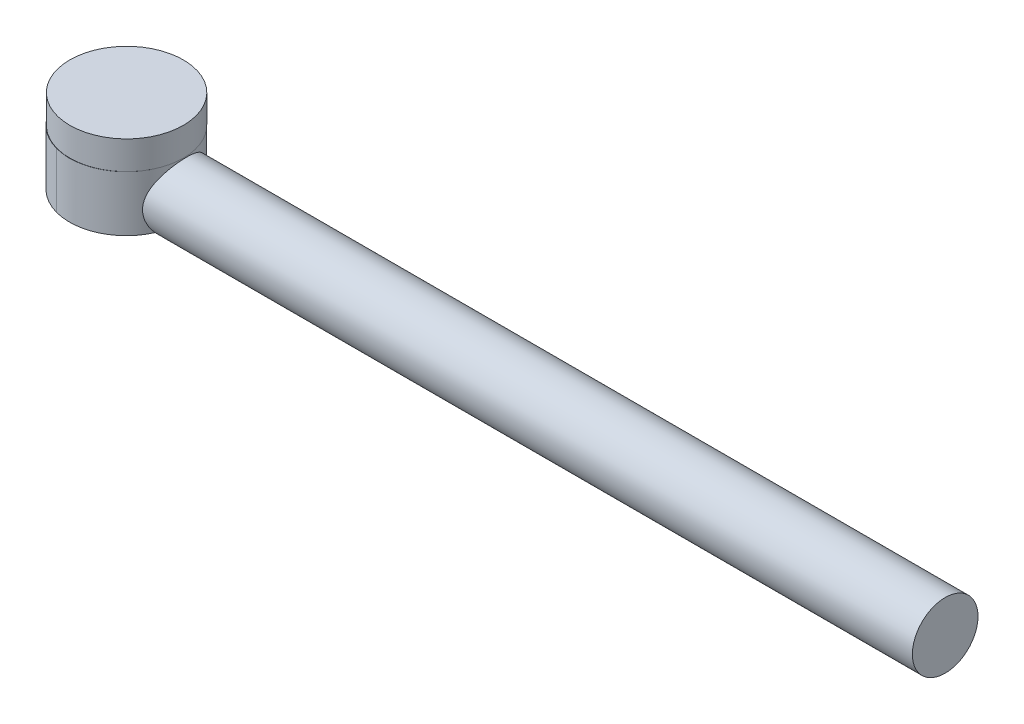
ISO-10303-21;
HEADER;
FILE_DESCRIPTION(('STEP AP214'),'2;1');
FILE_NAME('part.step','',(''),(''),'','','');
FILE_SCHEMA(('AUTOMOTIVE_DESIGN { 1 0 10303 214 1 1 1 1 }'));
ENDSEC;
DATA;
#1=APPLICATION_CONTEXT('core data for automotive mechanical design processes');
#2=APPLICATION_PROTOCOL_DEFINITION('international standard','automotive_design',2000,#1);
#3=PRODUCT_CONTEXT('',#1,'mechanical');
#4=PRODUCT('Part','Part','',(#3));
#5=PRODUCT_RELATED_PRODUCT_CATEGORY('part','',(#4));
#6=PRODUCT_DEFINITION_FORMATION('','',#4);
#7=PRODUCT_DEFINITION_CONTEXT('part definition',#1,'design');
#8=PRODUCT_DEFINITION('design','',#6,#7);
#9=PRODUCT_DEFINITION_SHAPE('','',#8);
#10=(LENGTH_UNIT() NAMED_UNIT(*) SI_UNIT(.MILLI.,.METRE.));
#11=(NAMED_UNIT(*) PLANE_ANGLE_UNIT() SI_UNIT($,.RADIAN.));
#12=(NAMED_UNIT(*) SI_UNIT($,.STERADIAN.) SOLID_ANGLE_UNIT());
#13=UNCERTAINTY_MEASURE_WITH_UNIT(LENGTH_MEASURE(1.E-05),#10,'distance_accuracy_value','');
#14=(GEOMETRIC_REPRESENTATION_CONTEXT(3) GLOBAL_UNCERTAINTY_ASSIGNED_CONTEXT((#13)) GLOBAL_UNIT_ASSIGNED_CONTEXT((#10,
#11,#12)) REPRESENTATION_CONTEXT('',''));
#15=CARTESIAN_POINT('',(0.,0.,0.));
#16=DIRECTION('',(0.,0.,1.));
#17=DIRECTION('',(1.,0.,0.));
#18=AXIS2_PLACEMENT_3D('',#15,#16,#17);
#19=CARTESIAN_POINT('',(64.8930840119267,57.1338139318965,55.1677389958048));
#20=DIRECTION('',(0.,-1.,0.));
#21=DIRECTION('',(0.,0.,-1.));
#22=AXIS2_PLACEMENT_3D('',#19,#20,#21);
#23=CYLINDRICAL_SURFACE('',#22,4.41488839314275);
#24=CARTESIAN_POINT('',(64.8930840119267,52.4498767005648,55.1677389958048));
#25=DIRECTION('',(0.,-1.,0.));
#26=DIRECTION('',(0.,0.,-1.));
#27=AXIS2_PLACEMENT_3D('',#24,#25,#26);
#28=CIRCLE('',#27,4.41488839314275);
#29=CARTESIAN_POINT('',(68.9050330531825,52.4498767005648,53.3250495444121));
#30=VERTEX_POINT('',#29);
#31=CARTESIAN_POINT('',(68.9909113998588,52.4498767005648,56.8106176348467));
#32=VERTEX_POINT('',#31);
#33=EDGE_CURVE('E207',#30,#32,#28,.T.);
#34=ORIENTED_EDGE('',*,*,#33,.F.);
#35=CARTESIAN_POINT('',(68.9909113998588,52.4498767005648,56.8106176348467));
#36=CARTESIAN_POINT('',(69.0078144566787,52.4016003833655,56.7684562948141));
#37=CARTESIAN_POINT('',(69.0247520904262,52.3550984496615,56.7243228512433));
#38=CARTESIAN_POINT('',(69.0582744814169,52.2658412597585,56.6322636013886));
#39=CARTESIAN_POINT('',(69.0748591168852,52.223087281135,56.5843365124668));
#40=CARTESIAN_POINT('',(69.1235446550623,52.1005096451875,56.4347934837326));
#41=CARTESIAN_POINT('',(69.1544541927399,52.026707648206,56.3277099660643));
#42=CARTESIAN_POINT('',(69.2097688504635,51.8973748785394,56.1010740903618));
#43=CARTESIAN_POINT('',(69.2341556601447,51.8418954400154,55.981487915739));
#44=CARTESIAN_POINT('',(69.2733733965552,51.7518590970686,55.7334175479235));
#45=CARTESIAN_POINT('',(69.288226397483,51.717253872611,55.6049546776448));
#46=CARTESIAN_POINT('',(69.3057470569595,51.6723307268607,55.3531128553064));
#47=CARTESIAN_POINT('',(69.309251143556,51.6603742627659,55.2300839241146));
#48=CARTESIAN_POINT('',(69.3058564218788,51.6562143034587,54.9838018676563));
#49=CARTESIAN_POINT('',(69.2989562245471,51.6640134458781,54.8605487146486));
#50=CARTESIAN_POINT('',(69.2760119066459,51.6977738442605,54.6252222311309));
#51=CARTESIAN_POINT('',(69.2605496016604,51.72260132873,54.5129249264647));
#52=CARTESIAN_POINT('',(69.2221510350125,51.7880883900838,54.2943912230823));
#53=CARTESIAN_POINT('',(69.1992121795555,51.8287534623621,54.1881569428261));
#54=CARTESIAN_POINT('',(69.1462001500448,51.927057981311,53.9783745022753));
#55=CARTESIAN_POINT('',(69.1158068264948,51.9855002935762,53.8752866279368));
#56=CARTESIAN_POINT('',(69.0510530494522,52.1166317011213,53.6800902535957));
#57=CARTESIAN_POINT('',(69.0166952572105,52.1893112618858,53.5879744717394));
#58=CARTESIAN_POINT('',(68.9689940424682,52.2969467631523,53.4708777996079));
#59=CARTESIAN_POINT('',(68.9562041303722,52.3264455469264,53.4405060421464));
#60=CARTESIAN_POINT('',(68.9306066087802,52.3869970260983,53.3814913803797));
#61=CARTESIAN_POINT('',(68.9177990802419,52.4180466334875,53.3528452727451));
#62=CARTESIAN_POINT('',(68.9050330531825,52.4498767005648,53.3250495444121));
#63=B_SPLINE_CURVE_WITH_KNOTS('',3,(#35,#36,#37,#38,#39,#40,#41,#42,#43,#44,#45,#46,#47,#48,#49,
#50,#51,#52,#53,#54,#55,#56,#57,#58,#59,#60,#61,#62),.UNSPECIFIED.,.F.,.F.,(4,2,2,2,2,2,2,2,2,2,
2,2,2,4),(0.,0.198746322642264,0.397560131155452,0.796564027129921,1.19667650861936,
1.59585921179006,1.96485942895716,2.33390891507627,2.68050697655425,3.02722540941497,
3.39279986113568,3.75813032385048,3.8907719823973,4.02315930678074),.UNSPECIFIED.);
#64=EDGE_CURVE('E171',#32,#30,#63,.T.);
#65=ORIENTED_EDGE('',*,*,#64,.F.);
#66=EDGE_LOOP('',(#34,#65));
#67=FACE_BOUND('',#66,.T.);
#68=ADVANCED_FACE('F39',(#67),#23,.F.);
#69=CARTESIAN_POINT('',(117.003928845521,53.9716158859328,55.0678335896294));
#70=DIRECTION('',(-1.,0.,0.));
#71=DIRECTION('',(0.,0.,1.));
#72=AXIS2_PLACEMENT_3D('',#69,#70,#71);
#73=CYLINDRICAL_SURFACE('',#72,2.31365217276674);
#74=CARTESIAN_POINT('',(68.5434227720107,52.4498767005648,56.8106176348467));
#75=CARTESIAN_POINT('',(68.5069523907389,52.5439531886697,56.892758787755));
#76=CARTESIAN_POINT('',(68.4704429118868,52.6448198490284,56.9674021232075));
#77=CARTESIAN_POINT('',(68.4012058045429,52.8590733863416,57.100385877513));
#78=CARTESIAN_POINT('',(68.3685092300784,52.9725501051983,57.1585972660198));
#79=CARTESIAN_POINT('',(68.3113198740907,53.2099783286772,57.2563069141519));
#80=CARTESIAN_POINT('',(68.2868630544629,53.3339728673884,57.295723447517));
#81=CARTESIAN_POINT('',(68.250536757608,53.5881982556529,57.3531888268447));
#82=CARTESIAN_POINT('',(68.2386166017318,53.7184017552519,57.3713237371143));
#83=CARTESIAN_POINT('',(68.2300400054733,53.965710159397,57.3844101443614));
#84=CARTESIAN_POINT('',(68.2318158441557,54.0826389412693,57.3817424074699));
#85=CARTESIAN_POINT('',(68.2466666219809,54.3141348096545,57.3589486797945));
#86=CARTESIAN_POINT('',(68.259752481922,54.4286995039332,57.3388058152008));
#87=CARTESIAN_POINT('',(68.2943309625598,54.6463749177604,57.2836096320574));
#88=CARTESIAN_POINT('',(68.3153595295227,54.7497717750421,57.2493713544843));
#89=CARTESIAN_POINT('',(68.3633612558271,54.9495565896685,57.1674253796885));
#90=CARTESIAN_POINT('',(68.3903353703013,55.0459434175623,57.1197155179536));
#91=CARTESIAN_POINT('',(68.4516260932584,55.2431932682411,57.0045470524501));
#92=CARTESIAN_POINT('',(68.4864422805773,55.3428405659077,56.9352723492761));
#93=CARTESIAN_POINT('',(68.5568931472737,55.5300241760108,56.7821815616824));
#94=CARTESIAN_POINT('',(68.5925285025695,55.6175500354794,56.6983530653938));
#95=CARTESIAN_POINT('',(68.665224454118,55.7881267423965,56.5071037579072));
#96=CARTESIAN_POINT('',(68.70198407683,55.8695287347883,56.3980826349448));
#97=CARTESIAN_POINT('',(68.7681123213135,56.0127056371901,56.1657945959757));
#98=CARTESIAN_POINT('',(68.7974848632292,56.074490961877,56.0425352867258));
#99=CARTESIAN_POINT('',(68.8436674338879,56.1726197516924,55.7927320422765));
#100=CARTESIAN_POINT('',(68.8611217768142,56.2102599294052,55.6668215575319));
#101=CARTESIAN_POINT('',(68.883815803044,56.263674931703,55.4094173137681));
#102=CARTESIAN_POINT('',(68.8890676966856,56.2794716074959,55.2779292702255));
#103=CARTESIAN_POINT('',(68.8865745135595,56.2878769225979,55.0301657704793));
#104=CARTESIAN_POINT('',(68.8803092424062,56.2830337060447,54.9139523954384));
#105=CARTESIAN_POINT('',(68.8579830745171,56.2562121373519,54.6844995933471));
#106=CARTESIAN_POINT('',(68.8419220369644,56.2342335388852,54.5712602090732));
#107=CARTESIAN_POINT('',(68.8015268543295,56.174709964582,54.3522328259717));
#108=CARTESIAN_POINT('',(68.7773055600629,56.1373758674948,54.2463657661398));
#109=CARTESIAN_POINT('',(68.7223113561808,56.0486704720295,54.0425556114575));
#110=CARTESIAN_POINT('',(68.691537026242,55.9972961298439,53.9446142408045));
#111=CARTESIAN_POINT('',(68.6219739957701,55.8758766221286,53.7481762913562));
#112=CARTESIAN_POINT('',(68.5826810122348,55.8044267573874,53.6507287224704));
#113=CARTESIAN_POINT('',(68.5015858071243,55.647858814463,53.4685686215057));
#114=CARTESIAN_POINT('',(68.4597805944529,55.5627242327669,53.3838717083791));
#115=CARTESIAN_POINT('',(68.3717396838883,55.3685863168317,53.2185868632326));
#116=CARTESIAN_POINT('',(68.3256126663348,55.2579258699584,53.139874720141));
#117=CARTESIAN_POINT('',(68.2398300214246,55.0226729813135,53.0022150204724));
#118=CARTESIAN_POINT('',(68.2001665526644,54.8980977347025,52.9432434221986));
#119=CARTESIAN_POINT('',(68.1411233306512,54.6675209789133,52.8587380466352));
#120=CARTESIAN_POINT('',(68.1191753929839,54.5638592341841,52.8286296580635));
#121=CARTESIAN_POINT('',(68.0854346911226,54.3518113577123,52.783067104065));
#122=CARTESIAN_POINT('',(68.0736280364746,54.2434319023995,52.76759289135));
#123=CARTESIAN_POINT('',(68.061865383991,54.0244799771392,52.7521747590771));
#124=CARTESIAN_POINT('',(68.0619553226232,53.9139006550331,52.7522910393126));
#125=CARTESIAN_POINT('',(68.0740894736592,53.6945367118622,52.7681991964891));
#126=CARTESIAN_POINT('',(68.0861381287629,53.5857527730568,52.783996899127));
#127=CARTESIAN_POINT('',(68.1195455075176,53.3783086554792,52.8291492200346));
#128=CARTESIAN_POINT('',(68.1404223193227,53.2794134484894,52.8578062416556));
#129=CARTESIAN_POINT('',(68.1890407774928,53.0876940003465,52.9272543536874));
#130=CARTESIAN_POINT('',(68.2167903763456,52.9948769506443,52.9680595118112));
#131=CARTESIAN_POINT('',(68.2744877327509,52.8229872343318,53.057278053999));
#132=CARTESIAN_POINT('',(68.3041286004359,52.7434058997935,53.1049217426247));
#133=CARTESIAN_POINT('',(68.3652753037609,52.5913219924016,53.208749445156));
#134=CARTESIAN_POINT('',(68.396772956877,52.5187916189298,53.2648974823259));
#135=CARTESIAN_POINT('',(68.4283830151182,52.4498767005648,53.3250495444121));
#136=B_SPLINE_CURVE_WITH_KNOTS('',3,(#74,#75,#76,#77,#78,#79,#80,#81,#82,#83,#84,#85,#86,#87,
#88,#89,#90,#91,#92,#93,#94,#95,#96,#97,#98,#99,#100,#101,#102,#103,#104,#105,#106,#107,#108,
#109,#110,#111,#112,#113,#114,#115,#116,#117,#118,#119,#120,#121,#122,#123,#124,#125,#126,#127,
#128,#129,#130,#131,#132,#133,#134,#135),.UNSPECIFIED.,.F.,.F.,(4,2,2,2,2,2,2,2,2,2,2,2,2,2,2,2,
2,2,2,2,2,2,2,2,2,2,2,2,2,2,4),(0.,0.390241286275457,0.783466681757577,1.17838670135114,
1.57170407325067,1.92072892610733,2.27009116946562,2.60159030639108,2.93314273642647,
3.31041716073554,3.68801492973468,4.10867766020667,4.52911668189437,4.92450104713221,
5.31948960168543,5.667220976659,6.01495735048679,6.35806973189139,6.70125655627354,
7.08094650868229,7.46109784374455,7.88934817110292,8.31707502532974,8.64618555947265,
8.97484459078756,9.30477271432826,9.63482345307508,9.94880274100355,10.2631470450824,
10.5546173906287,10.8448874698322),.UNSPECIFIED.);
#137=CARTESIAN_POINT('',(68.5434227720107,52.4498767005648,56.8106176348467));
#138=VERTEX_POINT('',#137);
#139=CARTESIAN_POINT('',(68.5429433041329,52.4511130740517,56.8116964212793));
#140=VERTEX_POINT('',#139);
#141=EDGE_CURVE('E140',#138,#140,#136,.T.);
#142=ORIENTED_EDGE('',*,*,#141,.F.);
#143=DIRECTION('',(-1.,0.,0.));
#144=VECTOR('',#143,1.);
#145=CARTESIAN_POINT('',(117.003928845521,52.4498767005648,56.8106176348467));
#146=LINE('',#145,#144);
#147=EDGE_CURVE('E181',#138,#32,#146,.F.);
#148=ORIENTED_EDGE('',*,*,#147,.T.);
#149=ORIENTED_EDGE('',*,*,#64,.T.);
#150=DIRECTION('',(-1.,0.,0.));
#151=VECTOR('',#150,1.);
#152=CARTESIAN_POINT('',(117.003928845521,52.4498767005648,53.3250495444121));
#153=LINE('',#152,#151);
#154=CARTESIAN_POINT('',(68.4283830151182,52.4498767005648,53.3250495444121));
#155=VERTEX_POINT('',#154);
#156=EDGE_CURVE('E180',#30,#155,#153,.T.);
#157=ORIENTED_EDGE('',*,*,#156,.T.);
#158=CARTESIAN_POINT('',(68.4278155881121,52.4511130740517,53.3239707579795));
#159=VERTEX_POINT('',#158);
#160=EDGE_CURVE('E208',#159,#155,#136,.T.);
#161=ORIENTED_EDGE('',*,*,#160,.F.);
#162=DIRECTION('',(-1.,0.,0.));
#163=VECTOR('',#162,1.);
#164=CARTESIAN_POINT('',(117.003928845521,52.4511130740516,53.3239707579795));
#165=LINE('',#164,#163);
#166=CARTESIAN_POINT('',(68.5670172295317,52.4511130740516,53.3239707579795));
#167=VERTEX_POINT('',#166);
#168=EDGE_CURVE('E283',#167,#159,#165,.T.);
#169=ORIENTED_EDGE('',*,*,#168,.F.);
#170=ORIENTED_EDGE('',*,*,#168,.T.);
#171=EDGE_CURVE('E157',#140,#159,#136,.T.);
#172=ORIENTED_EDGE('',*,*,#171,.F.);
#173=DIRECTION('',(-1.,0.,0.));
#174=VECTOR('',#173,1.);
#175=CARTESIAN_POINT('',(117.003928845521,52.4511130740516,56.8116964212793));
#176=LINE('',#175,#174);
#177=CARTESIAN_POINT('',(68.6601116588463,52.4511130740516,56.8116964212793));
#178=VERTEX_POINT('',#177);
#179=EDGE_CURVE('E285',#140,#178,#176,.F.);
#180=ORIENTED_EDGE('',*,*,#179,.T.);
#181=ORIENTED_EDGE('',*,*,#179,.F.);
#182=EDGE_LOOP('',(#142,#148,#149,#157,#161,#169,#170,#172,#180,#181));
#183=FACE_BOUND('',#182,.T.);
#184=CARTESIAN_POINT('',(122.503928845521,53.9716158859328,55.0678335896294));
#185=DIRECTION('',(1.,0.,0.));
#186=DIRECTION('',(0.,0.,-1.));
#187=AXIS2_PLACEMENT_3D('',#184,#185,#186);
#188=CIRCLE('',#187,2.31365217276674);
#189=CARTESIAN_POINT('',(122.503928845521,53.9716158859328,52.7541814168627));
#190=VERTEX_POINT('',#189);
#191=EDGE_CURVE('E271',#190,#190,#188,.T.);
#192=ORIENTED_EDGE('',*,*,#191,.F.);
#193=EDGE_LOOP('',(#192));
#194=FACE_BOUND('',#193,.T.);
#195=ADVANCED_FACE('F183',(#183,#194),#73,.T.);
#196=CARTESIAN_POINT('',(64.8879459892055,56.3538758021107,55.1865826936057));
#197=DIRECTION('',(0.,-1.,0.));
#198=DIRECTION('',(-0.964778994398282,0.,-0.263061764549393));
#199=AXIS2_PLACEMENT_3D('',#196,#197,#198);
#200=CYLINDRICAL_SURFACE('',#199,4.);
#201=ORIENTED_EDGE('',*,*,#171,.T.);
#202=CARTESIAN_POINT('',(64.8879459892055,52.4511130740516,55.1865826936057));
#203=DIRECTION('',(0.,1.,0.));
#204=DIRECTION('',(0.,0.,1.));
#205=AXIS2_PLACEMENT_3D('',#202,#203,#204);
#206=CIRCLE('',#205,4.);
#207=CARTESIAN_POINT('',(65.940193047403,52.4511130740516,51.3274667160125));
#208=VERTEX_POINT('',#207);
#209=EDGE_CURVE('E145',#159,#208,#206,.T.);
#210=ORIENTED_EDGE('',*,*,#209,.T.);
#211=DIRECTION('',(0.,-1.,0.));
#212=VECTOR('',#211,1.);
#213=CARTESIAN_POINT('',(65.940193047403,56.3538758021107,51.3274667160125));
#214=LINE('',#213,#212);
#215=CARTESIAN_POINT('',(65.940193047403,56.3538758021107,51.3274667160125));
#216=VERTEX_POINT('',#215);
#217=EDGE_CURVE('E152',#216,#208,#214,.T.);
#218=ORIENTED_EDGE('',*,*,#217,.F.);
#219=CARTESIAN_POINT('',(64.8879459892055,56.3538758021107,55.1865826936057));
#220=DIRECTION('',(0.,1.,0.));
#221=DIRECTION('',(0.964778994398282,0.,0.263061764549393));
#222=AXIS2_PLACEMENT_3D('',#219,#220,#221);
#223=CIRCLE('',#222,4.);
#224=CARTESIAN_POINT('',(68.6499324809759,56.3538758021107,56.5457948314771));
#225=VERTEX_POINT('',#224);
#226=EDGE_CURVE('E169',#225,#216,#223,.T.);
#227=ORIENTED_EDGE('',*,*,#226,.F.);
#228=CARTESIAN_POINT('',(63.835698931008,56.3538758021107,59.0456986711988));
#229=VERTEX_POINT('',#228);
#230=EDGE_CURVE('E114',#229,#225,#223,.T.);
#231=ORIENTED_EDGE('',*,*,#230,.F.);
#232=DIRECTION('',(0.,-1.,0.));
#233=VECTOR('',#232,1.);
#234=CARTESIAN_POINT('',(63.8356989310079,56.3538758021107,59.0456986711988));
#235=LINE('',#234,#233);
#236=CARTESIAN_POINT('',(63.8356989310079,52.4511130740516,59.0456986711988));
#237=VERTEX_POINT('',#236);
#238=EDGE_CURVE('E108',#229,#237,#235,.T.);
#239=ORIENTED_EDGE('',*,*,#238,.T.);
#240=EDGE_CURVE('E135',#237,#140,#206,.T.);
#241=ORIENTED_EDGE('',*,*,#240,.T.);
#242=EDGE_LOOP('',(#201,#210,#218,#227,#231,#239,#241));
#243=FACE_BOUND('',#242,.T.);
#244=ADVANCED_FACE('F154',(#243),#200,.T.);
#245=CARTESIAN_POINT('',(-26.7660584786313,56.3538758021107,30.1957150614133));
#246=DIRECTION('',(0.,1.,0.));
#247=DIRECTION('',(0.964778994398282,0.,0.263061764549393));
#248=AXIS2_PLACEMENT_3D('',#245,#246,#247);
#249=PLANE('',#248);
#250=CARTESIAN_POINT('',(64.8948077009227,56.3538758021107,55.1677389958048));
#251=DIRECTION('',(0.,1.,0.));
#252=DIRECTION('',(-1.,0.,0.));
#253=AXIS2_PLACEMENT_3D('',#250,#251,#252);
#254=CIRCLE('',#253,4.00000000000001);
#255=CARTESIAN_POINT('',(65.5565121931705,56.3538758021107,51.2228502565703));
#256=VERTEX_POINT('',#255);
#257=EDGE_CURVE('E120',#256,#225,#254,.T.);
#258=ORIENTED_EDGE('',*,*,#257,.F.);
#259=DIRECTION('',(0.964778994398282,0.,0.263061764549393));
#260=VECTOR('',#259,1.);
#261=CARTESIAN_POINT('',(-25.7138114204337,56.3538758021107,26.3365990838202));
#262=LINE('',#261,#260);
#263=CARTESIAN_POINT('',(65.4008600695111,56.3538758021107,51.1804093218656));
#264=VERTEX_POINT('',#263);
#265=EDGE_CURVE('E209',#264,#256,#262,.T.);
#266=ORIENTED_EDGE('',*,*,#265,.F.);
#267=CARTESIAN_POINT('',(64.8930840119267,56.3538758021107,55.1677389958048));
#268=DIRECTION('',(0.,1.,0.));
#269=DIRECTION('',(-1.,0.,0.));
#270=AXIS2_PLACEMENT_3D('',#267,#268,#269);
#271=CIRCLE('',#270,4.01953162113844);
#272=EDGE_CURVE('E105',#229,#264,#271,.F.);
#273=ORIENTED_EDGE('',*,*,#272,.F.);
#274=ORIENTED_EDGE('',*,*,#230,.T.);
#275=EDGE_LOOP('',(#258,#266,#273,#274));
#276=FACE_BOUND('',#275,.T.);
#277=ADVANCED_FACE('F240',(#276),#249,.T.);
#278=CARTESIAN_POINT('',(64.8930840119267,57.1338139318965,55.1677389958048));
#279=DIRECTION('',(0.,1.,0.));
#280=DIRECTION('',(0.,0.,1.));
#281=AXIS2_PLACEMENT_3D('',#278,#279,#280);
#282=CYLINDRICAL_SURFACE('',#281,4.01953162113844);
#283=DIRECTION('',(0.,1.,0.));
#284=VECTOR('',#283,1.);
#285=CARTESIAN_POINT('',(65.4008600695111,57.1338139318965,51.1804093218656));
#286=LINE('',#285,#284);
#287=CARTESIAN_POINT('',(65.4008600695111,52.4511130740516,51.1804093218656));
#288=VERTEX_POINT('',#287);
#289=EDGE_CURVE('E147',#264,#288,#286,.F.);
#290=ORIENTED_EDGE('',*,*,#289,.T.);
#291=CARTESIAN_POINT('',(64.8930840119267,52.4511130740516,55.1677389958048));
#292=DIRECTION('',(0.,1.,0.));
#293=DIRECTION('',(0.,0.,1.));
#294=AXIS2_PLACEMENT_3D('',#291,#292,#293);
#295=CIRCLE('',#294,4.01953162113844);
#296=EDGE_CURVE('E76',#288,#237,#295,.T.);
#297=ORIENTED_EDGE('',*,*,#296,.T.);
#298=ORIENTED_EDGE('',*,*,#238,.F.);
#299=ORIENTED_EDGE('',*,*,#272,.T.);
#300=EDGE_LOOP('',(#290,#297,#298,#299));
#301=FACE_BOUND('',#300,.T.);
#302=ADVANCED_FACE('F146',(#301),#282,.T.);
#303=CARTESIAN_POINT('',(-25.7138114204337,56.3538758021107,26.3365990838202));
#304=DIRECTION('',(0.263061764549393,0.,-0.964778994398282));
#305=DIRECTION('',(-0.964778994398282,0.,-0.263061764549393));
#306=AXIS2_PLACEMENT_3D('',#303,#304,#305);
#307=PLANE('',#306);
#308=DIRECTION('',(0.964778994398282,0.,0.263061764549393));
#309=VECTOR('',#308,1.);
#310=CARTESIAN_POINT('',(-25.7138114204337,52.4511130740516,26.3365990838202));
#311=LINE('',#310,#309);
#312=EDGE_CURVE('E170',#288,#208,#311,.T.);
#313=ORIENTED_EDGE('',*,*,#312,.F.);
#314=ORIENTED_EDGE('',*,*,#289,.F.);
#315=ORIENTED_EDGE('',*,*,#265,.T.);
#316=EDGE_CURVE('E210',#256,#216,#262,.T.);
#317=ORIENTED_EDGE('',*,*,#316,.T.);
#318=ORIENTED_EDGE('',*,*,#217,.T.);
#319=EDGE_LOOP('',(#313,#314,#315,#317,#318));
#320=FACE_BOUND('',#319,.T.);
#321=ADVANCED_FACE('F198',(#320),#307,.T.);
#322=ORIENTED_EDGE('',*,*,#240,.F.);
#323=CARTESIAN_POINT('',(63.8356989310079,52.4498767005648,59.0456986711988));
#324=VERTEX_POINT('',#323);
#325=EDGE_CURVE('E138',#237,#324,#235,.T.);
#326=ORIENTED_EDGE('',*,*,#325,.T.);
#327=CARTESIAN_POINT('',(64.8879459892055,52.4498767005648,55.1865826936057));
#328=DIRECTION('',(0.,1.,0.));
#329=DIRECTION('',(0.,0.,1.));
#330=AXIS2_PLACEMENT_3D('',#327,#328,#329);
#331=CIRCLE('',#330,4.);
#332=EDGE_CURVE('E151',#324,#138,#331,.T.);
#333=ORIENTED_EDGE('',*,*,#332,.T.);
#334=ORIENTED_EDGE('',*,*,#141,.T.);
#335=EDGE_LOOP('',(#322,#326,#333,#334));
#336=FACE_BOUND('',#335,.T.);
#337=ADVANCED_FACE('F136',(#336),#200,.T.);
#338=CARTESIAN_POINT('',(72.1919677870582,52.4498767005648,28.3990835020525));
#339=DIRECTION('',(0.,1.,0.));
#340=DIRECTION('',(0.,0.,1.));
#341=AXIS2_PLACEMENT_3D('',#338,#339,#340);
#342=PLANE('',#341);
#343=CARTESIAN_POINT('',(64.8930357480705,52.4498767005648,55.1677250772968));
#344=DIRECTION('',(0.,1.,0.));
#345=DIRECTION('',(0.,0.,1.));
#346=AXIS2_PLACEMENT_3D('',#343,#344,#345);
#347=CIRCLE('',#346,3.76068035935535);
#348=CARTESIAN_POINT('',(64.8930357480705,52.4498767005648,58.9284054366522));
#349=VERTEX_POINT('',#348);
#350=EDGE_CURVE('E43',#349,#349,#347,.T.);
#351=ORIENTED_EDGE('',*,*,#350,.T.);
#352=EDGE_LOOP('',(#351));
#353=FACE_BOUND('',#352,.T.);
#354=CARTESIAN_POINT('',(65.940193047403,52.4498767005648,51.3274667160125));
#355=VERTEX_POINT('',#354);
#356=EDGE_CURVE('E217',#155,#355,#331,.T.);
#357=ORIENTED_EDGE('',*,*,#356,.F.);
#358=ORIENTED_EDGE('',*,*,#156,.F.);
#359=ORIENTED_EDGE('',*,*,#33,.T.);
#360=ORIENTED_EDGE('',*,*,#147,.F.);
#361=ORIENTED_EDGE('',*,*,#332,.F.);
#362=CARTESIAN_POINT('',(64.8930840119267,52.4498767005648,55.1677389958048));
#363=DIRECTION('',(0.,1.,0.));
#364=DIRECTION('',(0.,0.,1.));
#365=AXIS2_PLACEMENT_3D('',#362,#363,#364);
#366=CIRCLE('',#365,4.01953162113844);
#367=CARTESIAN_POINT('',(65.4008600695111,52.4498767005648,51.1804093218656));
#368=VERTEX_POINT('',#367);
#369=EDGE_CURVE('E150',#368,#324,#366,.T.);
#370=ORIENTED_EDGE('',*,*,#369,.F.);
#371=DIRECTION('',(0.964778994398282,0.,0.263061764549393));
#372=VECTOR('',#371,1.);
#373=CARTESIAN_POINT('',(-25.7138114204337,52.4498767005648,26.3365990838202));
#374=LINE('',#373,#372);
#375=EDGE_CURVE('E218',#368,#355,#374,.T.);
#376=ORIENTED_EDGE('',*,*,#375,.T.);
#377=EDGE_LOOP('',(#357,#358,#359,#360,#361,#370,#376));
#378=FACE_BOUND('',#377,.T.);
#379=ADVANCED_FACE('F192',(#353,#378),#342,.F.);
#380=ORIENTED_EDGE('',*,*,#209,.F.);
#381=ORIENTED_EDGE('',*,*,#160,.T.);
#382=ORIENTED_EDGE('',*,*,#356,.T.);
#383=EDGE_CURVE('E57',#208,#355,#214,.T.);
#384=ORIENTED_EDGE('',*,*,#383,.F.);
#385=EDGE_LOOP('',(#380,#381,#382,#384));
#386=FACE_BOUND('',#385,.T.);
#387=ADVANCED_FACE('F193',(#386),#200,.T.);
#388=ORIENTED_EDGE('',*,*,#296,.F.);
#389=EDGE_CURVE('E70',#288,#368,#286,.F.);
#390=ORIENTED_EDGE('',*,*,#389,.T.);
#391=ORIENTED_EDGE('',*,*,#369,.T.);
#392=ORIENTED_EDGE('',*,*,#325,.F.);
#393=EDGE_LOOP('',(#388,#390,#391,#392));
#394=FACE_BOUND('',#393,.T.);
#395=ADVANCED_FACE('F149',(#394),#282,.T.);
#396=ORIENTED_EDGE('',*,*,#389,.F.);
#397=ORIENTED_EDGE('',*,*,#312,.T.);
#398=ORIENTED_EDGE('',*,*,#383,.T.);
#399=ORIENTED_EDGE('',*,*,#375,.F.);
#400=EDGE_LOOP('',(#396,#397,#398,#399));
#401=FACE_BOUND('',#400,.T.);
#402=ADVANCED_FACE('F239',(#401),#307,.T.);
#403=CARTESIAN_POINT('',(64.8948077009227,56.3538758021107,55.1677389958048));
#404=DIRECTION('',(0.,1.,0.));
#405=DIRECTION('',(-1.,0.,0.));
#406=AXIS2_PLACEMENT_3D('',#403,#404,#405);
#407=PLANE('',#406);
#408=EDGE_CURVE('E221',#225,#256,#254,.T.);
#409=ORIENTED_EDGE('',*,*,#408,.F.);
#410=ORIENTED_EDGE('',*,*,#226,.T.);
#411=ORIENTED_EDGE('',*,*,#316,.F.);
#412=EDGE_LOOP('',(#409,#410,#411));
#413=FACE_BOUND('',#412,.T.);
#414=ADVANCED_FACE('F191',(#413),#407,.F.);
#415=CARTESIAN_POINT('',(64.8948077009227,58.3538758021107,55.1677389958048));
#416=DIRECTION('',(0.,-1.,0.));
#417=DIRECTION('',(1.,0.,0.));
#418=AXIS2_PLACEMENT_3D('',#415,#416,#417);
#419=CYLINDRICAL_SURFACE('',#418,4.00000000000001);
#420=CARTESIAN_POINT('',(64.8948077009227,58.3538758021107,55.1677389958048));
#421=DIRECTION('',(0.,1.,0.));
#422=DIRECTION('',(-1.,0.,0.));
#423=AXIS2_PLACEMENT_3D('',#420,#421,#422);
#424=CIRCLE('',#423,4.00000000000001);
#425=CARTESIAN_POINT('',(60.8948077009227,58.3538758021107,55.1677389958048));
#426=VERTEX_POINT('',#425);
#427=EDGE_CURVE('E49',#426,#426,#424,.T.);
#428=ORIENTED_EDGE('',*,*,#427,.F.);
#429=EDGE_LOOP('',(#428));
#430=FACE_BOUND('',#429,.T.);
#431=ORIENTED_EDGE('',*,*,#408,.T.);
#432=ORIENTED_EDGE('',*,*,#257,.T.);
#433=EDGE_LOOP('',(#431,#432));
#434=FACE_BOUND('',#433,.T.);
#435=ADVANCED_FACE('F229',(#430,#434),#419,.T.);
#436=CARTESIAN_POINT('',(64.8948077009227,58.3538758021107,55.1677389958048));
#437=DIRECTION('',(0.,1.,0.));
#438=DIRECTION('',(-1.,0.,0.));
#439=AXIS2_PLACEMENT_3D('',#436,#437,#438);
#440=PLANE('',#439);
#441=ORIENTED_EDGE('',*,*,#427,.T.);
#442=EDGE_LOOP('',(#441));
#443=FACE_BOUND('',#442,.T.);
#444=ADVANCED_FACE('F298',(#443),#440,.T.);
#445=CARTESIAN_POINT('',(122.503928845521,53.9716158859328,55.0678335896294));
#446=DIRECTION('',(1.,0.,0.));
#447=DIRECTION('',(0.,0.,-1.));
#448=AXIS2_PLACEMENT_3D('',#445,#446,#447);
#449=PLANE('',#448);
#450=ORIENTED_EDGE('',*,*,#191,.T.);
#451=EDGE_LOOP('',(#450));
#452=FACE_BOUND('',#451,.T.);
#453=ADVANCED_FACE('F295',(#452),#449,.T.);
#454=CARTESIAN_POINT('',(67.191160065956,52.4493500066675,55.1666306170977));
#455=DIRECTION('',(0.,1.,0.));
#456=DIRECTION('',(0.,0.,1.));
#457=AXIS2_PLACEMENT_3D('',#454,#455,#456);
#458=PLANE('',#457);
#459=CARTESIAN_POINT('',(64.8930357480705,52.4493500066675,55.1677250772968));
#460=DIRECTION('',(0.,1.,0.));
#461=DIRECTION('',(0.,0.,1.));
#462=AXIS2_PLACEMENT_3D('',#459,#460,#461);
#463=CIRCLE('',#462,2.29812457849869);
#464=CARTESIAN_POINT('',(64.8930357480705,52.4493500066675,57.4658496557955));
#465=VERTEX_POINT('',#464);
#466=EDGE_CURVE('E272',#465,#465,#463,.T.);
#467=ORIENTED_EDGE('',*,*,#466,.T.);
#468=EDGE_LOOP('',(#467));
#469=FACE_BOUND('',#468,.T.);
#470=CARTESIAN_POINT('',(64.8930357480705,52.4493500066675,55.1677250772968));
#471=DIRECTION('',(0.,1.,0.));
#472=DIRECTION('',(0.,0.,1.));
#473=AXIS2_PLACEMENT_3D('',#470,#471,#472);
#474=CIRCLE('',#473,3.76068035935535);
#475=CARTESIAN_POINT('',(64.8930357480705,52.4493500066675,58.9284054366522));
#476=VERTEX_POINT('',#475);
#477=EDGE_CURVE('E276',#476,#476,#474,.T.);
#478=ORIENTED_EDGE('',*,*,#477,.F.);
#479=EDGE_LOOP('',(#478));
#480=FACE_BOUND('',#479,.T.);
#481=ADVANCED_FACE('F297',(#469,#480),#458,.F.);
#482=CARTESIAN_POINT('',(64.8930357480705,56.6741982646806,55.1677250772968));
#483=DIRECTION('',(0.,1.,0.));
#484=DIRECTION('',(0.,0.,1.));
#485=AXIS2_PLACEMENT_3D('',#482,#483,#484);
#486=CYLINDRICAL_SURFACE('',#485,3.76068035935535);
#487=ORIENTED_EDGE('',*,*,#477,.T.);
#488=EDGE_LOOP('',(#487));
#489=FACE_BOUND('',#488,.T.);
#490=ORIENTED_EDGE('',*,*,#350,.F.);
#491=EDGE_LOOP('',(#490));
#492=FACE_BOUND('',#491,.T.);
#493=ADVANCED_FACE('F304',(#489,#492),#486,.T.);
#494=CARTESIAN_POINT('',(64.8930357480705,56.6741982646806,55.1677250772968));
#495=DIRECTION('',(0.,1.,0.));
#496=DIRECTION('',(0.,0.,1.));
#497=AXIS2_PLACEMENT_3D('',#494,#495,#496);
#498=CYLINDRICAL_SURFACE('',#497,2.29812457849869);
#499=ORIENTED_EDGE('',*,*,#466,.F.);
#500=EDGE_LOOP('',(#499));
#501=FACE_BOUND('',#500,.T.);
#502=CARTESIAN_POINT('',(64.8930357480705,56.4714355366215,55.1677250772968));
#503=DIRECTION('',(0.,1.,0.));
#504=DIRECTION('',(-1.,0.,0.));
#505=AXIS2_PLACEMENT_3D('',#502,#503,#504);
#506=CIRCLE('',#505,2.29812457849869);
#507=CARTESIAN_POINT('',(62.5949111695718,56.4714355366215,55.1677250772968));
#508=VERTEX_POINT('',#507);
#509=EDGE_CURVE('E11',#508,#508,#506,.T.);
#510=ORIENTED_EDGE('',*,*,#509,.T.);
#511=EDGE_LOOP('',(#510));
#512=FACE_BOUND('',#511,.T.);
#513=ADVANCED_FACE('F307',(#501,#512),#498,.F.);
#514=CARTESIAN_POINT('',(64.893670414402,56.4714355366215,55.1661181207933));
#515=DIRECTION('',(0.,1.,0.));
#516=DIRECTION('',(-1.,0.,0.));
#517=AXIS2_PLACEMENT_3D('',#514,#515,#516);
#518=PLANE('',#517);
#519=ORIENTED_EDGE('',*,*,#509,.F.);
#520=EDGE_LOOP('',(#519));
#521=FACE_BOUND('',#520,.T.);
#522=ADVANCED_FACE('F41',(#521),#518,.F.);
#523=CLOSED_SHELL('',(#68,#195,#244,#277,#302,#321,#337,#379,#387,#395,#402,#414,#435,#444,#453,
#481,#493,#513,#522));
#524=MANIFOLD_SOLID_BREP('B2',#523);
#525=ADVANCED_BREP_SHAPE_REPRESENTATION('',(#18,#524),#14);
#526=SHAPE_DEFINITION_REPRESENTATION(#9,#525);
ENDSEC;
END-ISO-10303-21;
